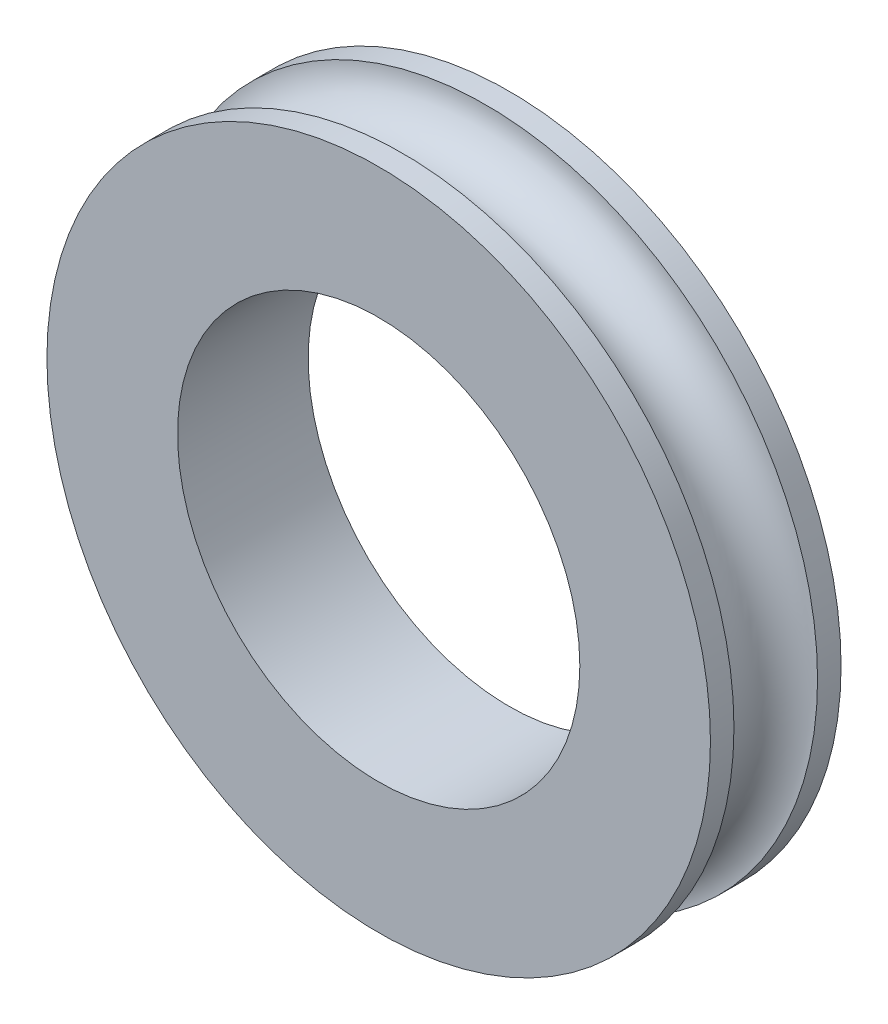
ISO-10303-21;
HEADER;
FILE_DESCRIPTION(('STEP AP214'),'2;1');
FILE_NAME('part.step','',(''),(''),'','','');
FILE_SCHEMA(('AUTOMOTIVE_DESIGN { 1 0 10303 214 1 1 1 1 }'));
ENDSEC;
DATA;
#1=APPLICATION_CONTEXT('core data for automotive mechanical design processes');
#2=APPLICATION_PROTOCOL_DEFINITION('international standard','automotive_design',2000,#1);
#3=PRODUCT_CONTEXT('',#1,'mechanical');
#4=PRODUCT('Part','Part','',(#3));
#5=PRODUCT_RELATED_PRODUCT_CATEGORY('part','',(#4));
#6=PRODUCT_DEFINITION_FORMATION('','',#4);
#7=PRODUCT_DEFINITION_CONTEXT('part definition',#1,'design');
#8=PRODUCT_DEFINITION('design','',#6,#7);
#9=PRODUCT_DEFINITION_SHAPE('','',#8);
#10=(LENGTH_UNIT() NAMED_UNIT(*) SI_UNIT(.MILLI.,.METRE.));
#11=(NAMED_UNIT(*) PLANE_ANGLE_UNIT() SI_UNIT($,.RADIAN.));
#12=(NAMED_UNIT(*) SI_UNIT($,.STERADIAN.) SOLID_ANGLE_UNIT());
#13=UNCERTAINTY_MEASURE_WITH_UNIT(LENGTH_MEASURE(1.E-05),#10,'distance_accuracy_value','');
#14=(GEOMETRIC_REPRESENTATION_CONTEXT(3) GLOBAL_UNCERTAINTY_ASSIGNED_CONTEXT((#13)) GLOBAL_UNIT_ASSIGNED_CONTEXT((#10,
#11,#12)) REPRESENTATION_CONTEXT('',''));
#15=CARTESIAN_POINT('',(0.,0.,0.));
#16=DIRECTION('',(0.,0.,1.));
#17=DIRECTION('',(1.,0.,0.));
#18=AXIS2_PLACEMENT_3D('',#15,#16,#17);
#19=CARTESIAN_POINT('',(0.,6.35,0.));
#20=DIRECTION('',(0.,0.,-1.));
#21=DIRECTION('',(-1.,0.,0.));
#22=AXIS2_PLACEMENT_3D('',#19,#20,#21);
#23=PLANE('',#22);
#24=CARTESIAN_POINT('',(0.,0.,0.));
#25=DIRECTION('',(0.,0.,1.));
#26=DIRECTION('',(1.,0.,0.));
#27=AXIS2_PLACEMENT_3D('',#24,#25,#26);
#28=CIRCLE('',#27,3.85);
#29=CARTESIAN_POINT('',(3.85,0.,0.));
#30=VERTEX_POINT('',#29);
#31=EDGE_CURVE('E53',#30,#30,#28,.T.);
#32=ORIENTED_EDGE('',*,*,#31,.F.);
#33=EDGE_LOOP('',(#32));
#34=FACE_BOUND('',#33,.T.);
#35=CARTESIAN_POINT('',(0.,0.,0.));
#36=DIRECTION('',(0.,0.,1.));
#37=DIRECTION('',(1.,0.,0.));
#38=AXIS2_PLACEMENT_3D('',#35,#36,#37);
#39=CIRCLE('',#38,6.35);
#40=CARTESIAN_POINT('',(6.35,0.,0.));
#41=VERTEX_POINT('',#40);
#42=EDGE_CURVE('E10',#41,#41,#39,.T.);
#43=ORIENTED_EDGE('',*,*,#42,.T.);
#44=EDGE_LOOP('',(#43));
#45=FACE_BOUND('',#44,.T.);
#46=ADVANCED_FACE('F31',(#34,#45),#23,.F.);
#47=CARTESIAN_POINT('',(0.,0.,0.));
#48=DIRECTION('',(0.,0.,1.));
#49=DIRECTION('',(1.,0.,0.));
#50=AXIS2_PLACEMENT_3D('',#47,#48,#49);
#51=CYLINDRICAL_SURFACE('',#50,6.35);
#52=ORIENTED_EDGE('',*,*,#42,.F.);
#53=EDGE_LOOP('',(#52));
#54=FACE_BOUND('',#53,.T.);
#55=CARTESIAN_POINT('',(0.,0.,-0.45));
#56=DIRECTION('',(0.,0.,1.));
#57=DIRECTION('',(1.,0.,0.));
#58=AXIS2_PLACEMENT_3D('',#55,#56,#57);
#59=CIRCLE('',#58,6.35);
#60=CARTESIAN_POINT('',(6.35,0.,-0.45));
#61=VERTEX_POINT('',#60);
#62=EDGE_CURVE('E37',#61,#61,#59,.T.);
#63=ORIENTED_EDGE('',*,*,#62,.T.);
#64=EDGE_LOOP('',(#63));
#65=FACE_BOUND('',#64,.T.);
#66=ADVANCED_FACE('F60',(#54,#65),#51,.T.);
#67=CARTESIAN_POINT('',(0.,0.,-1.25));
#68=DIRECTION('',(0.,0.,1.));
#69=DIRECTION('',(1.,0.,0.));
#70=AXIS2_PLACEMENT_3D('',#67,#68,#69);
#71=TOROIDAL_SURFACE('',#70,6.35,0.8);
#72=ORIENTED_EDGE('',*,*,#62,.F.);
#73=EDGE_LOOP('',(#72));
#74=FACE_BOUND('',#73,.T.);
#75=CARTESIAN_POINT('',(0.,0.,-2.05));
#76=DIRECTION('',(0.,0.,1.));
#77=DIRECTION('',(1.,0.,0.));
#78=AXIS2_PLACEMENT_3D('',#75,#76,#77);
#79=CIRCLE('',#78,6.35);
#80=CARTESIAN_POINT('',(6.35,0.,-2.05));
#81=VERTEX_POINT('',#80);
#82=EDGE_CURVE('E41',#81,#81,#79,.T.);
#83=ORIENTED_EDGE('',*,*,#82,.T.);
#84=EDGE_LOOP('',(#83));
#85=FACE_BOUND('',#84,.T.);
#86=ADVANCED_FACE('F64',(#74,#85),#71,.F.);
#87=CARTESIAN_POINT('',(0.,0.,0.));
#88=DIRECTION('',(0.,0.,1.));
#89=DIRECTION('',(1.,0.,0.));
#90=AXIS2_PLACEMENT_3D('',#87,#88,#89);
#91=CYLINDRICAL_SURFACE('',#90,6.35);
#92=ORIENTED_EDGE('',*,*,#82,.F.);
#93=EDGE_LOOP('',(#92));
#94=FACE_BOUND('',#93,.T.);
#95=CARTESIAN_POINT('',(0.,0.,-2.5));
#96=DIRECTION('',(0.,0.,1.));
#97=DIRECTION('',(1.,0.,0.));
#98=AXIS2_PLACEMENT_3D('',#95,#96,#97);
#99=CIRCLE('',#98,6.35);
#100=CARTESIAN_POINT('',(6.35,0.,-2.5));
#101=VERTEX_POINT('',#100);
#102=EDGE_CURVE('E45',#101,#101,#99,.T.);
#103=ORIENTED_EDGE('',*,*,#102,.T.);
#104=EDGE_LOOP('',(#103));
#105=FACE_BOUND('',#104,.T.);
#106=ADVANCED_FACE('F69',(#94,#105),#91,.T.);
#107=CARTESIAN_POINT('',(0.,3.85,-2.5));
#108=DIRECTION('',(0.,0.,1.));
#109=DIRECTION('',(1.,0.,0.));
#110=AXIS2_PLACEMENT_3D('',#107,#108,#109);
#111=PLANE('',#110);
#112=ORIENTED_EDGE('',*,*,#102,.F.);
#113=EDGE_LOOP('',(#112));
#114=FACE_BOUND('',#113,.T.);
#115=CARTESIAN_POINT('',(0.,0.,-2.5));
#116=DIRECTION('',(0.,0.,1.));
#117=DIRECTION('',(1.,0.,0.));
#118=AXIS2_PLACEMENT_3D('',#115,#116,#117);
#119=CIRCLE('',#118,3.85);
#120=CARTESIAN_POINT('',(3.85,0.,-2.5));
#121=VERTEX_POINT('',#120);
#122=EDGE_CURVE('E50',#121,#121,#119,.T.);
#123=ORIENTED_EDGE('',*,*,#122,.T.);
#124=EDGE_LOOP('',(#123));
#125=FACE_BOUND('',#124,.T.);
#126=ADVANCED_FACE('F75',(#114,#125),#111,.F.);
#127=CARTESIAN_POINT('',(0.,0.,0.));
#128=DIRECTION('',(0.,0.,1.));
#129=DIRECTION('',(1.,0.,0.));
#130=AXIS2_PLACEMENT_3D('',#127,#128,#129);
#131=CYLINDRICAL_SURFACE('',#130,3.85);
#132=ORIENTED_EDGE('',*,*,#122,.F.);
#133=EDGE_LOOP('',(#132));
#134=FACE_BOUND('',#133,.T.);
#135=ORIENTED_EDGE('',*,*,#31,.T.);
#136=EDGE_LOOP('',(#135));
#137=FACE_BOUND('',#136,.T.);
#138=ADVANCED_FACE('F57',(#134,#137),#131,.F.);
#139=CLOSED_SHELL('',(#46,#66,#86,#106,#126,#138));
#140=MANIFOLD_SOLID_BREP('B2',#139);
#141=ADVANCED_BREP_SHAPE_REPRESENTATION('',(#18,#140),#14);
#142=SHAPE_DEFINITION_REPRESENTATION(#9,#141);
ENDSEC;
END-ISO-10303-21;
